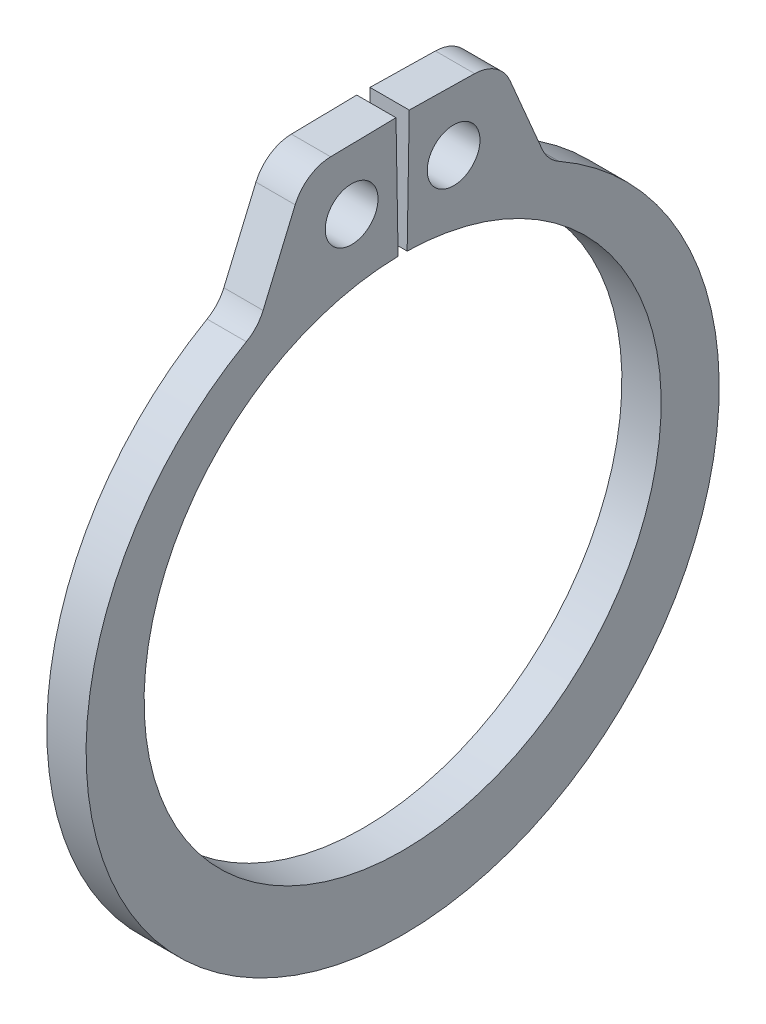
ISO-10303-21;
HEADER;
FILE_DESCRIPTION(('STEP AP214'),'2;1');
FILE_NAME('part.step','',(''),(''),'','','');
FILE_SCHEMA(('AUTOMOTIVE_DESIGN { 1 0 10303 214 1 1 1 1 }'));
ENDSEC;
DATA;
#1=APPLICATION_CONTEXT('core data for automotive mechanical design processes');
#2=APPLICATION_PROTOCOL_DEFINITION('international standard','automotive_design',2000,#1);
#3=PRODUCT_CONTEXT('',#1,'mechanical');
#4=PRODUCT('Part','Part','',(#3));
#5=PRODUCT_RELATED_PRODUCT_CATEGORY('part','',(#4));
#6=PRODUCT_DEFINITION_FORMATION('','',#4);
#7=PRODUCT_DEFINITION_CONTEXT('part definition',#1,'design');
#8=PRODUCT_DEFINITION('design','',#6,#7);
#9=PRODUCT_DEFINITION_SHAPE('','',#8);
#10=(LENGTH_UNIT() NAMED_UNIT(*) SI_UNIT(.MILLI.,.METRE.));
#11=(NAMED_UNIT(*) PLANE_ANGLE_UNIT() SI_UNIT($,.RADIAN.));
#12=(NAMED_UNIT(*) SI_UNIT($,.STERADIAN.) SOLID_ANGLE_UNIT());
#13=UNCERTAINTY_MEASURE_WITH_UNIT(LENGTH_MEASURE(1.E-05),#10,'distance_accuracy_value','');
#14=(GEOMETRIC_REPRESENTATION_CONTEXT(3) GLOBAL_UNCERTAINTY_ASSIGNED_CONTEXT((#13)) GLOBAL_UNIT_ASSIGNED_CONTEXT((#10,
#11,#12)) REPRESENTATION_CONTEXT('',''));
#15=CARTESIAN_POINT('',(0.,0.,0.));
#16=DIRECTION('',(0.,0.,1.));
#17=DIRECTION('',(1.,0.,0.));
#18=AXIS2_PLACEMENT_3D('',#15,#16,#17);
#19=CARTESIAN_POINT('',(0.4445,0.,0.));
#20=DIRECTION('',(1.,0.,0.));
#21=DIRECTION('',(0.,0.,-1.));
#22=AXIS2_PLACEMENT_3D('',#19,#20,#21);
#23=PLANE('',#22);
#24=CARTESIAN_POINT('',(0.4445,7.20724610900659,1.15465964864512));
#25=DIRECTION('',(1.,0.,0.));
#26=DIRECTION('',(0.,0.,-1.));
#27=AXIS2_PLACEMENT_3D('',#24,#25,#26);
#28=CIRCLE('',#27,0.5969);
#29=CARTESIAN_POINT('',(0.4445,7.20724610900659,0.557759648645121));
#30=VERTEX_POINT('',#29);
#31=EDGE_CURVE('E221',#30,#30,#28,.T.);
#32=ORIENTED_EDGE('',*,*,#31,.F.);
#33=EDGE_LOOP('',(#32));
#34=FACE_BOUND('',#33,.T.);
#35=DIRECTION('',(0.,-0.0174524064372841,0.999847695156391));
#36=VECTOR('',#35,1.);
#37=CARTESIAN_POINT('',(0.4445,8.59659049818514,0.15005404530712));
#38=LINE('',#37,#36);
#39=CARTESIAN_POINT('',(0.4445,8.59659049818514,0.15005404530712));
#40=VERTEX_POINT('',#39);
#41=CARTESIAN_POINT('',(0.4445,8.57074959100772,1.63047862600547));
#42=VERTEX_POINT('',#41);
#43=EDGE_CURVE('E133',#40,#42,#38,.T.);
#44=ORIENTED_EDGE('',*,*,#43,.T.);
#45=CARTESIAN_POINT('',(0.4445,7.68188499001368,1.61496343668273));
#46=DIRECTION('',(1.,0.,0.));
#47=DIRECTION('',(0.,0.,-1.));
#48=AXIS2_PLACEMENT_3D('',#45,#46,#47);
#49=CIRCLE('',#48,0.889);
#50=CARTESIAN_POINT('',(0.4445,8.02998759243226,2.43297662617872));
#51=VERTEX_POINT('',#50);
#52=EDGE_CURVE('E174',#42,#51,#49,.T.);
#53=ORIENTED_EDGE('',*,*,#52,.T.);
#54=DIRECTION('',(0.,-0.920149819455567,0.391566481910655));
#55=VECTOR('',#54,1.);
#56=CARTESIAN_POINT('',(0.4445,8.56068391718107,2.20714069332188));
#57=LINE('',#56,#55);
#58=CARTESIAN_POINT('',(0.4445,6.32221463110735,3.15971333386378));
#59=VERTEX_POINT('',#58);
#60=EDGE_CURVE('E213',#51,#59,#57,.T.);
#61=ORIENTED_EDGE('',*,*,#60,.T.);
#62=CARTESIAN_POINT('',(0.4445,6.67031723352593,3.97772652335978));
#63=DIRECTION('',(1.,0.,0.));
#64=DIRECTION('',(0.,0.,-1.));
#65=AXIS2_PLACEMENT_3D('',#62,#63,#64);
#66=CIRCLE('',#65,0.889);
#67=CARTESIAN_POINT('',(0.4445,5.89719335877508,3.53886381784673));
#68=VERTEX_POINT('',#67);
#69=EDGE_CURVE('E181',#59,#68,#66,.F.);
#70=ORIENTED_EDGE('',*,*,#69,.T.);
#71=CARTESIAN_POINT('',(0.4445,-0.337057291142251,0.));
#72=DIRECTION('',(1.,0.,0.));
#73=DIRECTION('',(0.,0.,-1.));
#74=AXIS2_PLACEMENT_3D('',#71,#72,#73);
#75=CIRCLE('',#74,7.16864270885775);
#76=CARTESIAN_POINT('',(0.4445,5.89719335877508,-3.53886381784673));
#77=VERTEX_POINT('',#76);
#78=EDGE_CURVE('E206',#68,#77,#75,.T.);
#79=ORIENTED_EDGE('',*,*,#78,.T.);
#80=CARTESIAN_POINT('',(0.4445,6.67031723352593,-3.97772652335978));
#81=DIRECTION('',(1.,0.,0.));
#82=DIRECTION('',(0.,0.,-1.));
#83=AXIS2_PLACEMENT_3D('',#80,#81,#82);
#84=CIRCLE('',#83,0.889);
#85=CARTESIAN_POINT('',(0.4445,6.32221463110735,-3.15971333386378));
#86=VERTEX_POINT('',#85);
#87=EDGE_CURVE('E11',#77,#86,#84,.F.);
#88=ORIENTED_EDGE('',*,*,#87,.T.);
#89=DIRECTION('',(0.,0.920149819455567,0.391566481910655));
#90=VECTOR('',#89,1.);
#91=CARTESIAN_POINT('',(0.4445,8.56068391718107,-2.20714069332188));
#92=LINE('',#91,#90);
#93=CARTESIAN_POINT('',(0.4445,8.02998759243226,-2.43297662617872));
#94=VERTEX_POINT('',#93);
#95=EDGE_CURVE('E205',#86,#94,#92,.T.);
#96=ORIENTED_EDGE('',*,*,#95,.T.);
#97=CARTESIAN_POINT('',(0.4445,7.68188499001368,-1.61496343668273));
#98=DIRECTION('',(1.,0.,0.));
#99=DIRECTION('',(0.,0.,-1.));
#100=AXIS2_PLACEMENT_3D('',#97,#98,#99);
#101=CIRCLE('',#100,0.889);
#102=CARTESIAN_POINT('',(0.4445,8.57074959100772,-1.63047862600547));
#103=VERTEX_POINT('',#102);
#104=EDGE_CURVE('E49',#94,#103,#101,.T.);
#105=ORIENTED_EDGE('',*,*,#104,.T.);
#106=DIRECTION('',(0.,0.0174524064372841,0.999847695156391));
#107=VECTOR('',#106,1.);
#108=CARTESIAN_POINT('',(0.4445,8.59659049818514,-0.15005404530712));
#109=LINE('',#108,#107);
#110=CARTESIAN_POINT('',(0.4445,8.59659049818514,-0.15005404530712));
#111=VERTEX_POINT('',#110);
#112=EDGE_CURVE('E210',#103,#111,#109,.T.);
#113=ORIENTED_EDGE('',*,*,#112,.T.);
#114=DIRECTION('',(0.,-0.999847695156391,0.0174524064372835));
#115=VECTOR('',#114,1.);
#116=CARTESIAN_POINT('',(0.4445,5.85380830083212,-0.102178603968364));
#117=LINE('',#116,#115);
#118=CARTESIAN_POINT('',(0.4445,5.85380830083212,-0.102178603968364));
#119=VERTEX_POINT('',#118);
#120=EDGE_CURVE('E139',#111,#119,#117,.T.);
#121=ORIENTED_EDGE('',*,*,#120,.T.);
#122=CARTESIAN_POINT('',(0.4445,0.,0.));
#123=DIRECTION('',(-1.,0.,0.));
#124=DIRECTION('',(0.,0.,-1.));
#125=AXIS2_PLACEMENT_3D('',#122,#123,#124);
#126=CIRCLE('',#125,5.8547);
#127=CARTESIAN_POINT('',(0.4445,5.85380830083212,0.102178603968364));
#128=VERTEX_POINT('',#127);
#129=EDGE_CURVE('E134',#119,#128,#126,.T.);
#130=ORIENTED_EDGE('',*,*,#129,.T.);
#131=DIRECTION('',(0.,0.999847695156391,0.0174524064372835));
#132=VECTOR('',#131,1.);
#133=CARTESIAN_POINT('',(0.4445,5.85380830083212,0.102178603968364));
#134=LINE('',#133,#132);
#135=EDGE_CURVE('E125',#128,#40,#134,.T.);
#136=ORIENTED_EDGE('',*,*,#135,.T.);
#137=EDGE_LOOP('',(#44,#53,#61,#70,#79,#88,#96,#105,#113,#121,#130,#136));
#138=FACE_BOUND('',#137,.T.);
#139=CARTESIAN_POINT('',(0.4445,7.20724610900659,-1.15465964864512));
#140=DIRECTION('',(1.,0.,0.));
#141=DIRECTION('',(0.,0.,-1.));
#142=AXIS2_PLACEMENT_3D('',#139,#140,#141);
#143=CIRCLE('',#142,0.5969);
#144=CARTESIAN_POINT('',(0.4445,7.20724610900659,-1.75155964864512));
#145=VERTEX_POINT('',#144);
#146=EDGE_CURVE('E247',#145,#145,#143,.T.);
#147=ORIENTED_EDGE('',*,*,#146,.F.);
#148=EDGE_LOOP('',(#147));
#149=FACE_BOUND('',#148,.T.);
#150=ADVANCED_FACE('F34',(#34,#138,#149),#23,.T.);
#151=CARTESIAN_POINT('',(-0.4445,0.,0.));
#152=DIRECTION('',(1.,0.,0.));
#153=DIRECTION('',(0.,0.,-1.));
#154=AXIS2_PLACEMENT_3D('',#151,#152,#153);
#155=PLANE('',#154);
#156=CARTESIAN_POINT('',(-0.4445,7.20724610900659,1.15465964864512));
#157=DIRECTION('',(1.,0.,0.));
#158=DIRECTION('',(0.,0.,-1.));
#159=AXIS2_PLACEMENT_3D('',#156,#157,#158);
#160=CIRCLE('',#159,0.5969);
#161=CARTESIAN_POINT('',(-0.4445,7.20724610900659,0.557759648645121));
#162=VERTEX_POINT('',#161);
#163=EDGE_CURVE('E244',#162,#162,#160,.T.);
#164=ORIENTED_EDGE('',*,*,#163,.T.);
#165=EDGE_LOOP('',(#164));
#166=FACE_BOUND('',#165,.T.);
#167=DIRECTION('',(0.,-0.920149819455567,0.391566481910655));
#168=VECTOR('',#167,1.);
#169=CARTESIAN_POINT('',(-0.4445,8.56068391718107,2.20714069332188));
#170=LINE('',#169,#168);
#171=CARTESIAN_POINT('',(-0.4445,8.02998759243226,2.43297662617872));
#172=VERTEX_POINT('',#171);
#173=CARTESIAN_POINT('',(-0.4445,6.32221463110735,3.15971333386378));
#174=VERTEX_POINT('',#173);
#175=EDGE_CURVE('E200',#172,#174,#170,.T.);
#176=ORIENTED_EDGE('',*,*,#175,.F.);
#177=CARTESIAN_POINT('',(-0.4445,7.68188499001368,1.61496343668273));
#178=DIRECTION('',(1.,0.,0.));
#179=DIRECTION('',(0.,0.,-1.));
#180=AXIS2_PLACEMENT_3D('',#177,#178,#179);
#181=CIRCLE('',#180,0.889);
#182=CARTESIAN_POINT('',(-0.4445,8.57074959100772,1.63047862600547));
#183=VERTEX_POINT('',#182);
#184=EDGE_CURVE('E170',#172,#183,#181,.F.);
#185=ORIENTED_EDGE('',*,*,#184,.T.);
#186=DIRECTION('',(0.,-0.0174524064372841,0.999847695156391));
#187=VECTOR('',#186,1.);
#188=CARTESIAN_POINT('',(-0.4445,8.59659049818514,0.15005404530712));
#189=LINE('',#188,#187);
#190=CARTESIAN_POINT('',(-0.4445,8.59659049818514,0.15005404530712));
#191=VERTEX_POINT('',#190);
#192=EDGE_CURVE('E223',#191,#183,#189,.T.);
#193=ORIENTED_EDGE('',*,*,#192,.F.);
#194=DIRECTION('',(0.,0.999847695156391,0.0174524064372835));
#195=VECTOR('',#194,1.);
#196=CARTESIAN_POINT('',(-0.4445,5.85380830083212,0.102178603968364));
#197=LINE('',#196,#195);
#198=CARTESIAN_POINT('',(-0.4445,5.85380830083212,0.102178603968364));
#199=VERTEX_POINT('',#198);
#200=EDGE_CURVE('E220',#199,#191,#197,.T.);
#201=ORIENTED_EDGE('',*,*,#200,.F.);
#202=CARTESIAN_POINT('',(-0.4445,0.,0.));
#203=DIRECTION('',(-1.,0.,0.));
#204=DIRECTION('',(0.,0.,-1.));
#205=AXIS2_PLACEMENT_3D('',#202,#203,#204);
#206=CIRCLE('',#205,5.8547);
#207=CARTESIAN_POINT('',(-0.4445,5.85380830083212,-0.102178603968364));
#208=VERTEX_POINT('',#207);
#209=EDGE_CURVE('E147',#208,#199,#206,.T.);
#210=ORIENTED_EDGE('',*,*,#209,.F.);
#211=DIRECTION('',(0.,-0.999847695156391,0.0174524064372835));
#212=VECTOR('',#211,1.);
#213=CARTESIAN_POINT('',(-0.4445,5.85380830083212,-0.102178603968364));
#214=LINE('',#213,#212);
#215=CARTESIAN_POINT('',(-0.4445,8.59659049818514,-0.15005404530712));
#216=VERTEX_POINT('',#215);
#217=EDGE_CURVE('E143',#216,#208,#214,.T.);
#218=ORIENTED_EDGE('',*,*,#217,.F.);
#219=DIRECTION('',(0.,0.0174524064372841,0.999847695156391));
#220=VECTOR('',#219,1.);
#221=CARTESIAN_POINT('',(-0.4445,8.59659049818514,-0.15005404530712));
#222=LINE('',#221,#220);
#223=CARTESIAN_POINT('',(-0.4445,8.57074959100772,-1.63047862600547));
#224=VERTEX_POINT('',#223);
#225=EDGE_CURVE('E228',#224,#216,#222,.T.);
#226=ORIENTED_EDGE('',*,*,#225,.F.);
#227=CARTESIAN_POINT('',(-0.4445,7.68188499001368,-1.61496343668273));
#228=DIRECTION('',(1.,0.,0.));
#229=DIRECTION('',(0.,0.,-1.));
#230=AXIS2_PLACEMENT_3D('',#227,#228,#229);
#231=CIRCLE('',#230,0.889);
#232=CARTESIAN_POINT('',(-0.4445,8.02998759243226,-2.43297662617872));
#233=VERTEX_POINT('',#232);
#234=EDGE_CURVE('E168',#224,#233,#231,.F.);
#235=ORIENTED_EDGE('',*,*,#234,.T.);
#236=DIRECTION('',(0.,0.920149819455567,0.391566481910655));
#237=VECTOR('',#236,1.);
#238=CARTESIAN_POINT('',(-0.4445,8.56068391718107,-2.20714069332188));
#239=LINE('',#238,#237);
#240=CARTESIAN_POINT('',(-0.4445,6.32221463110735,-3.15971333386378));
#241=VERTEX_POINT('',#240);
#242=EDGE_CURVE('E191',#241,#233,#239,.T.);
#243=ORIENTED_EDGE('',*,*,#242,.F.);
#244=CARTESIAN_POINT('',(-0.4445,6.67031723352593,-3.97772652335978));
#245=DIRECTION('',(1.,0.,0.));
#246=DIRECTION('',(0.,0.,-1.));
#247=AXIS2_PLACEMENT_3D('',#244,#245,#246);
#248=CIRCLE('',#247,0.889);
#249=CARTESIAN_POINT('',(-0.4445,5.89719335877508,-3.53886381784673));
#250=VERTEX_POINT('',#249);
#251=EDGE_CURVE('E42',#241,#250,#248,.T.);
#252=ORIENTED_EDGE('',*,*,#251,.T.);
#253=CARTESIAN_POINT('',(-0.4445,-0.337057291142251,0.));
#254=DIRECTION('',(1.,0.,0.));
#255=DIRECTION('',(0.,0.,-1.));
#256=AXIS2_PLACEMENT_3D('',#253,#254,#255);
#257=CIRCLE('',#256,7.16864270885775);
#258=CARTESIAN_POINT('',(-0.4445,5.89719335877508,3.53886381784673));
#259=VERTEX_POINT('',#258);
#260=EDGE_CURVE('E189',#259,#250,#257,.T.);
#261=ORIENTED_EDGE('',*,*,#260,.F.);
#262=CARTESIAN_POINT('',(-0.4445,6.67031723352593,3.97772652335978));
#263=DIRECTION('',(1.,0.,0.));
#264=DIRECTION('',(0.,0.,-1.));
#265=AXIS2_PLACEMENT_3D('',#262,#263,#264);
#266=CIRCLE('',#265,0.889);
#267=EDGE_CURVE('E179',#259,#174,#266,.T.);
#268=ORIENTED_EDGE('',*,*,#267,.T.);
#269=EDGE_LOOP('',(#176,#185,#193,#201,#210,#218,#226,#235,#243,#252,#261,#268));
#270=FACE_BOUND('',#269,.T.);
#271=CARTESIAN_POINT('',(-0.4445,7.20724610900659,-1.15465964864512));
#272=DIRECTION('',(1.,0.,0.));
#273=DIRECTION('',(0.,0.,-1.));
#274=AXIS2_PLACEMENT_3D('',#271,#272,#273);
#275=CIRCLE('',#274,0.5969);
#276=CARTESIAN_POINT('',(-0.4445,7.20724610900659,-1.75155964864512));
#277=VERTEX_POINT('',#276);
#278=EDGE_CURVE('E250',#277,#277,#275,.T.);
#279=ORIENTED_EDGE('',*,*,#278,.T.);
#280=EDGE_LOOP('',(#279));
#281=FACE_BOUND('',#280,.T.);
#282=ADVANCED_FACE('F187',(#166,#270,#281),#155,.F.);
#283=CARTESIAN_POINT('',(0.4445,0.,0.));
#284=DIRECTION('',(-1.,0.,0.));
#285=DIRECTION('',(0.,0.,1.));
#286=AXIS2_PLACEMENT_3D('',#283,#284,#285);
#287=CYLINDRICAL_SURFACE('',#286,5.8547);
#288=ORIENTED_EDGE('',*,*,#209,.T.);
#289=DIRECTION('',(-1.,0.,0.));
#290=VECTOR('',#289,1.);
#291=CARTESIAN_POINT('',(0.4445,5.85380830083212,0.102178603968364));
#292=LINE('',#291,#290);
#293=EDGE_CURVE('E129',#128,#199,#292,.T.);
#294=ORIENTED_EDGE('',*,*,#293,.F.);
#295=ORIENTED_EDGE('',*,*,#129,.F.);
#296=DIRECTION('',(-1.,0.,0.));
#297=VECTOR('',#296,1.);
#298=CARTESIAN_POINT('',(0.4445,5.85380830083212,-0.102178603968364));
#299=LINE('',#298,#297);
#300=EDGE_CURVE('E218',#119,#208,#299,.T.);
#301=ORIENTED_EDGE('',*,*,#300,.T.);
#302=EDGE_LOOP('',(#288,#294,#295,#301));
#303=FACE_BOUND('',#302,.T.);
#304=ADVANCED_FACE('F145',(#303),#287,.F.);
#305=CARTESIAN_POINT('',(0.4445,5.85380830083212,0.102178603968364));
#306=DIRECTION('',(0.,-0.0174524064372835,0.999847695156391));
#307=DIRECTION('',(0.,-0.999847695156391,-0.0174524064372835));
#308=AXIS2_PLACEMENT_3D('',#305,#306,#307);
#309=PLANE('',#308);
#310=ORIENTED_EDGE('',*,*,#200,.T.);
#311=DIRECTION('',(-1.,0.,0.));
#312=VECTOR('',#311,1.);
#313=CARTESIAN_POINT('',(0.4445,8.59659049818514,0.15005404530712));
#314=LINE('',#313,#312);
#315=EDGE_CURVE('E132',#40,#191,#314,.T.);
#316=ORIENTED_EDGE('',*,*,#315,.F.);
#317=ORIENTED_EDGE('',*,*,#135,.F.);
#318=ORIENTED_EDGE('',*,*,#293,.T.);
#319=EDGE_LOOP('',(#310,#316,#317,#318));
#320=FACE_BOUND('',#319,.T.);
#321=ADVANCED_FACE('F127',(#320),#309,.F.);
#322=CARTESIAN_POINT('',(0.4445,8.59659049818514,0.15005404530712));
#323=DIRECTION('',(0.,-0.999847695156391,-0.0174524064372841));
#324=DIRECTION('',(0.,0.0174524064372841,-0.999847695156391));
#325=AXIS2_PLACEMENT_3D('',#322,#323,#324);
#326=PLANE('',#325);
#327=ORIENTED_EDGE('',*,*,#192,.T.);
#328=DIRECTION('',(-1.,0.,0.));
#329=VECTOR('',#328,1.);
#330=CARTESIAN_POINT('',(0.4445,8.57074959100772,1.63047862600547));
#331=LINE('',#330,#329);
#332=EDGE_CURVE('E57',#183,#42,#331,.F.);
#333=ORIENTED_EDGE('',*,*,#332,.T.);
#334=ORIENTED_EDGE('',*,*,#43,.F.);
#335=ORIENTED_EDGE('',*,*,#315,.T.);
#336=EDGE_LOOP('',(#327,#333,#334,#335));
#337=FACE_BOUND('',#336,.T.);
#338=ADVANCED_FACE('F239',(#337),#326,.F.);
#339=CARTESIAN_POINT('',(0.4445,8.56068391718107,2.20714069332188));
#340=DIRECTION('',(0.,-0.391566481910655,-0.920149819455567));
#341=DIRECTION('',(0.,0.920149819455567,-0.391566481910655));
#342=AXIS2_PLACEMENT_3D('',#339,#340,#341);
#343=PLANE('',#342);
#344=ORIENTED_EDGE('',*,*,#175,.T.);
#345=DIRECTION('',(1.,0.,0.));
#346=VECTOR('',#345,1.);
#347=CARTESIAN_POINT('',(0.4445,6.32221463110735,3.15971333386378));
#348=LINE('',#347,#346);
#349=EDGE_CURVE('E161',#174,#59,#348,.T.);
#350=ORIENTED_EDGE('',*,*,#349,.T.);
#351=ORIENTED_EDGE('',*,*,#60,.F.);
#352=DIRECTION('',(-1.,0.,0.));
#353=VECTOR('',#352,1.);
#354=CARTESIAN_POINT('',(0.4445,8.02998759243226,2.43297662617872));
#355=LINE('',#354,#353);
#356=EDGE_CURVE('E158',#51,#172,#355,.T.);
#357=ORIENTED_EDGE('',*,*,#356,.T.);
#358=EDGE_LOOP('',(#344,#350,#351,#357));
#359=FACE_BOUND('',#358,.T.);
#360=ADVANCED_FACE('F280',(#359),#343,.F.);
#361=CARTESIAN_POINT('',(0.4445,-0.337057291142251,0.));
#362=DIRECTION('',(-1.,0.,0.));
#363=DIRECTION('',(0.,0.,1.));
#364=AXIS2_PLACEMENT_3D('',#361,#362,#363);
#365=CYLINDRICAL_SURFACE('',#364,7.16864270885775);
#366=ORIENTED_EDGE('',*,*,#78,.F.);
#367=DIRECTION('',(-1.,0.,0.));
#368=VECTOR('',#367,1.);
#369=CARTESIAN_POINT('',(0.4445,5.89719335877508,3.53886381784672));
#370=LINE('',#369,#368);
#371=EDGE_CURVE('E150',#68,#259,#370,.T.);
#372=ORIENTED_EDGE('',*,*,#371,.T.);
#373=ORIENTED_EDGE('',*,*,#260,.T.);
#374=DIRECTION('',(-1.,0.,0.));
#375=VECTOR('',#374,1.);
#376=CARTESIAN_POINT('',(0.4445,5.89719335877508,-3.53886381784672));
#377=LINE('',#376,#375);
#378=EDGE_CURVE('E148',#250,#77,#377,.F.);
#379=ORIENTED_EDGE('',*,*,#378,.T.);
#380=EDGE_LOOP('',(#366,#372,#373,#379));
#381=FACE_BOUND('',#380,.T.);
#382=ADVANCED_FACE('F197',(#381),#365,.T.);
#383=CARTESIAN_POINT('',(0.4445,8.56068391718107,-2.20714069332188));
#384=DIRECTION('',(0.,-0.391566481910655,0.920149819455567));
#385=DIRECTION('',(0.,-0.920149819455567,-0.391566481910655));
#386=AXIS2_PLACEMENT_3D('',#383,#384,#385);
#387=PLANE('',#386);
#388=ORIENTED_EDGE('',*,*,#95,.F.);
#389=DIRECTION('',(1.,0.,0.));
#390=VECTOR('',#389,1.);
#391=CARTESIAN_POINT('',(-0.4445,6.32221463110735,-3.15971333386378));
#392=LINE('',#391,#390);
#393=EDGE_CURVE('E165',#86,#241,#392,.F.);
#394=ORIENTED_EDGE('',*,*,#393,.T.);
#395=ORIENTED_EDGE('',*,*,#242,.T.);
#396=DIRECTION('',(-1.,0.,0.));
#397=VECTOR('',#396,1.);
#398=CARTESIAN_POINT('',(0.4445,8.02998759243226,-2.43297662617872));
#399=LINE('',#398,#397);
#400=EDGE_CURVE('E163',#233,#94,#399,.F.);
#401=ORIENTED_EDGE('',*,*,#400,.T.);
#402=EDGE_LOOP('',(#388,#394,#395,#401));
#403=FACE_BOUND('',#402,.T.);
#404=ADVANCED_FACE('F208',(#403),#387,.F.);
#405=CARTESIAN_POINT('',(0.4445,8.59659049818514,-0.15005404530712));
#406=DIRECTION('',(0.,-0.999847695156391,0.0174524064372841));
#407=DIRECTION('',(0.,-0.0174524064372841,-0.999847695156391));
#408=AXIS2_PLACEMENT_3D('',#405,#406,#407);
#409=PLANE('',#408);
#410=ORIENTED_EDGE('',*,*,#112,.F.);
#411=DIRECTION('',(-1.,0.,0.));
#412=VECTOR('',#411,1.);
#413=CARTESIAN_POINT('',(0.4445,8.57074959100772,-1.63047862600547));
#414=LINE('',#413,#412);
#415=EDGE_CURVE('E176',#103,#224,#414,.T.);
#416=ORIENTED_EDGE('',*,*,#415,.T.);
#417=ORIENTED_EDGE('',*,*,#225,.T.);
#418=DIRECTION('',(-1.,0.,0.));
#419=VECTOR('',#418,1.);
#420=CARTESIAN_POINT('',(0.4445,8.59659049818514,-0.15005404530712));
#421=LINE('',#420,#419);
#422=EDGE_CURVE('E152',#111,#216,#421,.T.);
#423=ORIENTED_EDGE('',*,*,#422,.F.);
#424=EDGE_LOOP('',(#410,#416,#417,#423));
#425=FACE_BOUND('',#424,.T.);
#426=ADVANCED_FACE('F273',(#425),#409,.F.);
#427=CARTESIAN_POINT('',(0.4445,5.85380830083212,-0.102178603968364));
#428=DIRECTION('',(0.,-0.0174524064372835,-0.999847695156391));
#429=DIRECTION('',(0.,0.999847695156391,-0.0174524064372835));
#430=AXIS2_PLACEMENT_3D('',#427,#428,#429);
#431=PLANE('',#430);
#432=ORIENTED_EDGE('',*,*,#217,.T.);
#433=ORIENTED_EDGE('',*,*,#300,.F.);
#434=ORIENTED_EDGE('',*,*,#120,.F.);
#435=ORIENTED_EDGE('',*,*,#422,.T.);
#436=EDGE_LOOP('',(#432,#433,#434,#435));
#437=FACE_BOUND('',#436,.T.);
#438=ADVANCED_FACE('F235',(#437),#431,.F.);
#439=CARTESIAN_POINT('',(0.4445,7.20724610900659,1.15465964864512));
#440=DIRECTION('',(-1.,0.,0.));
#441=DIRECTION('',(0.,0.,1.));
#442=AXIS2_PLACEMENT_3D('',#439,#440,#441);
#443=CYLINDRICAL_SURFACE('',#442,0.5969);
#444=ORIENTED_EDGE('',*,*,#31,.T.);
#445=EDGE_LOOP('',(#444));
#446=FACE_BOUND('',#445,.T.);
#447=ORIENTED_EDGE('',*,*,#163,.F.);
#448=EDGE_LOOP('',(#447));
#449=FACE_BOUND('',#448,.T.);
#450=ADVANCED_FACE('F268',(#446,#449),#443,.F.);
#451=CARTESIAN_POINT('',(0.4445,7.20724610900659,-1.15465964864512));
#452=DIRECTION('',(-1.,0.,0.));
#453=DIRECTION('',(0.,0.,1.));
#454=AXIS2_PLACEMENT_3D('',#451,#452,#453);
#455=CYLINDRICAL_SURFACE('',#454,0.5969);
#456=ORIENTED_EDGE('',*,*,#146,.T.);
#457=EDGE_LOOP('',(#456));
#458=FACE_BOUND('',#457,.T.);
#459=ORIENTED_EDGE('',*,*,#278,.F.);
#460=EDGE_LOOP('',(#459));
#461=FACE_BOUND('',#460,.T.);
#462=ADVANCED_FACE('F256',(#458,#461),#455,.F.);
#463=CARTESIAN_POINT('',(0.4445,6.67031723352593,3.97772652335978));
#464=DIRECTION('',(-1.,0.,0.));
#465=DIRECTION('',(0.,0.,1.));
#466=AXIS2_PLACEMENT_3D('',#463,#464,#465);
#467=CYLINDRICAL_SURFACE('',#466,0.889);
#468=ORIENTED_EDGE('',*,*,#69,.F.);
#469=ORIENTED_EDGE('',*,*,#349,.F.);
#470=ORIENTED_EDGE('',*,*,#267,.F.);
#471=ORIENTED_EDGE('',*,*,#371,.F.);
#472=EDGE_LOOP('',(#468,#469,#470,#471));
#473=FACE_BOUND('',#472,.T.);
#474=ADVANCED_FACE('F290',(#473),#467,.F.);
#475=CARTESIAN_POINT('',(0.4445,6.67031723352593,-3.97772652335978));
#476=DIRECTION('',(-1.,0.,0.));
#477=DIRECTION('',(0.,0.,1.));
#478=AXIS2_PLACEMENT_3D('',#475,#476,#477);
#479=CYLINDRICAL_SURFACE('',#478,0.889);
#480=ORIENTED_EDGE('',*,*,#87,.F.);
#481=ORIENTED_EDGE('',*,*,#378,.F.);
#482=ORIENTED_EDGE('',*,*,#251,.F.);
#483=ORIENTED_EDGE('',*,*,#393,.F.);
#484=EDGE_LOOP('',(#480,#481,#482,#483));
#485=FACE_BOUND('',#484,.T.);
#486=ADVANCED_FACE('F203',(#485),#479,.F.);
#487=CARTESIAN_POINT('',(0.4445,7.68188499001368,1.61496343668273));
#488=DIRECTION('',(-1.,0.,0.));
#489=DIRECTION('',(0.,0.,1.));
#490=AXIS2_PLACEMENT_3D('',#487,#488,#489);
#491=CYLINDRICAL_SURFACE('',#490,0.889);
#492=ORIENTED_EDGE('',*,*,#52,.F.);
#493=ORIENTED_EDGE('',*,*,#332,.F.);
#494=ORIENTED_EDGE('',*,*,#184,.F.);
#495=ORIENTED_EDGE('',*,*,#356,.F.);
#496=EDGE_LOOP('',(#492,#493,#494,#495));
#497=FACE_BOUND('',#496,.T.);
#498=ADVANCED_FACE('F295',(#497),#491,.T.);
#499=CARTESIAN_POINT('',(0.4445,7.68188499001368,-1.61496343668273));
#500=DIRECTION('',(-1.,0.,0.));
#501=DIRECTION('',(0.,0.,1.));
#502=AXIS2_PLACEMENT_3D('',#499,#500,#501);
#503=CYLINDRICAL_SURFACE('',#502,0.889);
#504=ORIENTED_EDGE('',*,*,#104,.F.);
#505=ORIENTED_EDGE('',*,*,#400,.F.);
#506=ORIENTED_EDGE('',*,*,#234,.F.);
#507=ORIENTED_EDGE('',*,*,#415,.F.);
#508=EDGE_LOOP('',(#504,#505,#506,#507));
#509=FACE_BOUND('',#508,.T.);
#510=ADVANCED_FACE('F36',(#509),#503,.T.);
#511=CLOSED_SHELL('',(#150,#282,#304,#321,#338,#360,#382,#404,#426,#438,#450,#462,#474,#486,
#498,#510));
#512=MANIFOLD_SOLID_BREP('B2',#511);
#513=ADVANCED_BREP_SHAPE_REPRESENTATION('',(#18,#512),#14);
#514=SHAPE_DEFINITION_REPRESENTATION(#9,#513);
ENDSEC;
END-ISO-10303-21;
